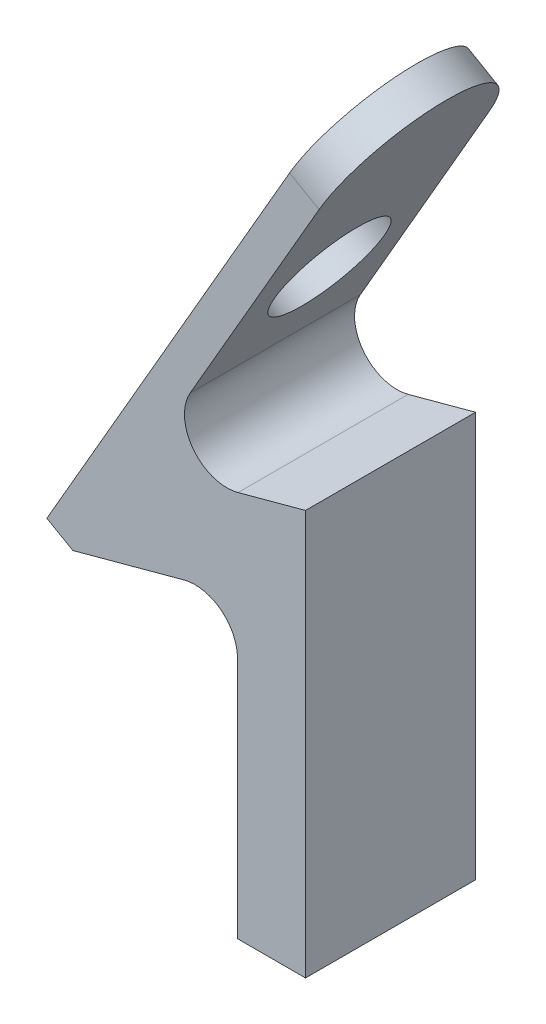
ISO-10303-21;
HEADER;
FILE_DESCRIPTION(('STEP AP214'),'2;1');
FILE_NAME('part.step','',(''),(''),'','','');
FILE_SCHEMA(('AUTOMOTIVE_DESIGN { 1 0 10303 214 1 1 1 1 }'));
ENDSEC;
DATA;
#1=APPLICATION_CONTEXT('core data for automotive mechanical design processes');
#2=APPLICATION_PROTOCOL_DEFINITION('international standard','automotive_design',2000,#1);
#3=PRODUCT_CONTEXT('',#1,'mechanical');
#4=PRODUCT('Part','Part','',(#3));
#5=PRODUCT_RELATED_PRODUCT_CATEGORY('part','',(#4));
#6=PRODUCT_DEFINITION_FORMATION('','',#4);
#7=PRODUCT_DEFINITION_CONTEXT('part definition',#1,'design');
#8=PRODUCT_DEFINITION('design','',#6,#7);
#9=PRODUCT_DEFINITION_SHAPE('','',#8);
#10=(LENGTH_UNIT() NAMED_UNIT(*) SI_UNIT(.MILLI.,.METRE.));
#11=(NAMED_UNIT(*) PLANE_ANGLE_UNIT() SI_UNIT($,.RADIAN.));
#12=(NAMED_UNIT(*) SI_UNIT($,.STERADIAN.) SOLID_ANGLE_UNIT());
#13=UNCERTAINTY_MEASURE_WITH_UNIT(LENGTH_MEASURE(1.E-05),#10,'distance_accuracy_value','');
#14=(GEOMETRIC_REPRESENTATION_CONTEXT(3) GLOBAL_UNCERTAINTY_ASSIGNED_CONTEXT((#13)) GLOBAL_UNIT_ASSIGNED_CONTEXT((#10,
#11,#12)) REPRESENTATION_CONTEXT('',''));
#15=CARTESIAN_POINT('',(0.,0.,0.));
#16=DIRECTION('',(0.,0.,1.));
#17=DIRECTION('',(1.,0.,0.));
#18=AXIS2_PLACEMENT_3D('',#15,#16,#17);
#19=CARTESIAN_POINT('',(-8.59073119504501,31.7410205271065,144.870489570875));
#20=DIRECTION('',(-0.261251278843011,0.965270826920037,0.));
#21=DIRECTION('',(-0.965270826920037,-0.261251278843011,0.));
#22=AXIS2_PLACEMENT_3D('',#19,#20,#21);
#23=PLANE('',#22);
#24=DIRECTION('',(-0.965270826920037,-0.261251278843011,0.));
#25=VECTOR('',#24,1.);
#26=CARTESIAN_POINT('',(-8.59073119504501,31.7410205271065,164.870489570875));
#27=LINE('',#26,#25);
#28=CARTESIAN_POINT('',(-70.5886003262694,14.9612503896881,164.870489570875));
#29=VERTEX_POINT('',#28);
#30=CARTESIAN_POINT('',(-78.5182177538816,12.8150934398199,164.870489570875));
#31=VERTEX_POINT('',#30);
#32=EDGE_CURVE('E140',#29,#31,#27,.T.);
#33=ORIENTED_EDGE('',*,*,#32,.F.);
#34=DIRECTION('',(0.,0.,-1.));
#35=VECTOR('',#34,1.);
#36=CARTESIAN_POINT('',(-70.5886003262694,14.9612503896881,144.870489570875));
#37=LINE('',#36,#35);
#38=CARTESIAN_POINT('',(-70.5886003262694,14.9612503896881,144.870489570875));
#39=VERTEX_POINT('',#38);
#40=EDGE_CURVE('E53',#29,#39,#37,.T.);
#41=ORIENTED_EDGE('',*,*,#40,.T.);
#42=DIRECTION('',(-0.965270826920037,-0.261251278843011,0.));
#43=VECTOR('',#42,1.);
#44=CARTESIAN_POINT('',(-8.59073119504501,31.7410205271065,144.870489570875));
#45=LINE('',#44,#43);
#46=CARTESIAN_POINT('',(-78.5182177538816,12.8150934398199,144.870489570875));
#47=VERTEX_POINT('',#46);
#48=EDGE_CURVE('E208',#39,#47,#45,.T.);
#49=ORIENTED_EDGE('',*,*,#48,.T.);
#50=DIRECTION('',(0.,0.,1.));
#51=VECTOR('',#50,1.);
#52=CARTESIAN_POINT('',(-78.5182177538816,12.8150934398199,144.870489570875));
#53=LINE('',#52,#51);
#54=EDGE_CURVE('E159',#47,#31,#53,.T.);
#55=ORIENTED_EDGE('',*,*,#54,.T.);
#56=EDGE_LOOP('',(#33,#41,#49,#55));
#57=FACE_BOUND('',#56,.T.);
#58=ADVANCED_FACE('F37',(#57),#23,.T.);
#59=CARTESIAN_POINT('',(0.,-32.6577021365863,144.870489570875));
#60=DIRECTION('',(0.,1.,0.));
#61=DIRECTION('',(0.,0.,1.));
#62=AXIS2_PLACEMENT_3D('',#59,#60,#61);
#63=PLANE('',#62);
#64=DIRECTION('',(0.,0.,-1.));
#65=VECTOR('',#64,1.);
#66=CARTESIAN_POINT('',(-70.5886003262694,-32.6577021365863,164.870489570875));
#67=LINE('',#66,#65);
#68=CARTESIAN_POINT('',(-70.5886003262694,-32.6577021365863,164.870489570875));
#69=VERTEX_POINT('',#68);
#70=CARTESIAN_POINT('',(-70.5886003262694,-32.6577021365863,144.870489570875));
#71=VERTEX_POINT('',#70);
#72=EDGE_CURVE('E121',#69,#71,#67,.T.);
#73=ORIENTED_EDGE('',*,*,#72,.F.);
#74=DIRECTION('',(-1.,0.,0.));
#75=VECTOR('',#74,1.);
#76=CARTESIAN_POINT('',(0.,-32.6577021365863,164.870489570875));
#77=LINE('',#76,#75);
#78=CARTESIAN_POINT('',(-78.5886003262694,-32.6577021365863,164.870489570875));
#79=VERTEX_POINT('',#78);
#80=EDGE_CURVE('E130',#69,#79,#77,.T.);
#81=ORIENTED_EDGE('',*,*,#80,.T.);
#82=DIRECTION('',(0.,0.,1.));
#83=VECTOR('',#82,1.);
#84=CARTESIAN_POINT('',(-78.5886003262694,-32.6577021365863,144.870489570875));
#85=LINE('',#84,#83);
#86=CARTESIAN_POINT('',(-78.5886003262694,-32.6577021365863,144.870489570875));
#87=VERTEX_POINT('',#86);
#88=EDGE_CURVE('E151',#87,#79,#85,.T.);
#89=ORIENTED_EDGE('',*,*,#88,.F.);
#90=DIRECTION('',(-1.,0.,0.));
#91=VECTOR('',#90,1.);
#92=CARTESIAN_POINT('',(0.,-32.6577021365863,144.870489570875));
#93=LINE('',#92,#91);
#94=EDGE_CURVE('E132',#71,#87,#93,.T.);
#95=ORIENTED_EDGE('',*,*,#94,.F.);
#96=EDGE_LOOP('',(#73,#81,#89,#95));
#97=FACE_BOUND('',#96,.T.);
#98=ADVANCED_FACE('F128',(#97),#63,.F.);
#99=CARTESIAN_POINT('',(0.,0.,144.870489570875));
#100=DIRECTION('',(0.,0.,1.));
#101=DIRECTION('',(1.,0.,0.));
#102=AXIS2_PLACEMENT_3D('',#99,#100,#101);
#103=PLANE('',#102);
#104=DIRECTION('',(0.,1.,0.));
#105=VECTOR('',#104,1.);
#106=CARTESIAN_POINT('',(-70.5886003262694,-32.6577021365863,144.870489570875));
#107=LINE('',#106,#105);
#108=EDGE_CURVE('E133',#71,#39,#107,.T.);
#109=ORIENTED_EDGE('',*,*,#108,.F.);
#110=ORIENTED_EDGE('',*,*,#94,.T.);
#111=DIRECTION('',(0.,-1.,0.));
#112=VECTOR('',#111,1.);
#113=CARTESIAN_POINT('',(-78.5886003262694,0.,144.870489570875));
#114=LINE('',#113,#112);
#115=CARTESIAN_POINT('',(-78.5886003262694,-4.0968896803454,144.870489570875));
#116=VERTEX_POINT('',#115);
#117=EDGE_CURVE('E211',#116,#87,#114,.T.);
#118=ORIENTED_EDGE('',*,*,#117,.F.);
#119=CARTESIAN_POINT('',(-83.5886003262694,-4.0968896803454,144.870489570875));
#120=DIRECTION('',(0.,0.,1.));
#121=DIRECTION('',(1.,0.,0.));
#122=AXIS2_PLACEMENT_3D('',#119,#120,#121);
#123=CIRCLE('',#122,5.);
#124=CARTESIAN_POINT('',(-84.8948567204845,0.729464454254775,144.870489570875));
#125=VERTEX_POINT('',#124);
#126=EDGE_CURVE('E166',#116,#125,#123,.T.);
#127=ORIENTED_EDGE('',*,*,#126,.T.);
#128=DIRECTION('',(-0.965270826920037,-0.261251278843011,0.));
#129=VECTOR('',#128,1.);
#130=CARTESIAN_POINT('',(-5.97821840661488,22.0883122579062,144.870489570875));
#131=LINE('',#130,#129);
#132=CARTESIAN_POINT('',(-97.948495719236,-2.8035128065004,144.870489570875));
#133=VERTEX_POINT('',#132);
#134=EDGE_CURVE('E185',#125,#133,#131,.T.);
#135=ORIENTED_EDGE('',*,*,#134,.T.);
#136=DIRECTION('',(-0.867282098260253,0.497816996533157,0.));
#137=VECTOR('',#136,1.);
#138=CARTESIAN_POINT('',(-101.007077292801,-1.04789730877683,144.870489570875));
#139=LINE('',#138,#137);
#140=CARTESIAN_POINT('',(-101.007077292801,-1.04789730877683,144.870489570875));
#141=VERTEX_POINT('',#140);
#142=EDGE_CURVE('E46',#133,#141,#139,.T.);
#143=ORIENTED_EDGE('',*,*,#142,.T.);
#144=DIRECTION('',(-0.499999999999999,-0.86602540378444,0.));
#145=VECTOR('',#144,1.);
#146=CARTESIAN_POINT('',(-75.3015551246221,43.4753731215978,144.870489570875));
#147=LINE('',#146,#145);
#148=CARTESIAN_POINT('',(-72.4609033212013,48.3955263717347,144.870489570875));
#149=VERTEX_POINT('',#148);
#150=EDGE_CURVE('E183',#149,#141,#147,.T.);
#151=ORIENTED_EDGE('',*,*,#150,.F.);
#152=DIRECTION('',(0.86602540378444,-0.499999999999997,0.));
#153=VECTOR('',#152,1.);
#154=CARTESIAN_POINT('',(2.8406518034208,4.92015325013702,144.870489570875));
#155=LINE('',#154,#153);
#156=CARTESIAN_POINT('',(-68.9968017060635,46.3955263717347,144.870489570875));
#157=VERTEX_POINT('',#156);
#158=EDGE_CURVE('E150',#149,#157,#155,.T.);
#159=ORIENTED_EDGE('',*,*,#158,.T.);
#160=DIRECTION('',(-0.5,-0.866025403784439,0.));
#161=VECTOR('',#160,1.);
#162=CARTESIAN_POINT('',(-71.8374535094842,41.4753731215979,144.870489570875));
#163=LINE('',#162,#161);
#164=CARTESIAN_POINT('',(-84.1546011670188,20.1414475744201,144.870489570875));
#165=VERTEX_POINT('',#164);
#166=EDGE_CURVE('E154',#157,#165,#163,.T.);
#167=ORIENTED_EDGE('',*,*,#166,.T.);
#168=CARTESIAN_POINT('',(-79.8244741480966,17.6414475744201,144.870489570875));
#169=DIRECTION('',(0.,0.,1.));
#170=DIRECTION('',(1.,0.,0.));
#171=AXIS2_PLACEMENT_3D('',#168,#169,#170);
#172=CIRCLE('',#171,5.);
#173=EDGE_CURVE('E170',#165,#47,#172,.T.);
#174=ORIENTED_EDGE('',*,*,#173,.T.);
#175=ORIENTED_EDGE('',*,*,#48,.F.);
#176=EDGE_LOOP('',(#109,#110,#118,#127,#135,#143,#151,#159,#167,#174,#175));
#177=FACE_BOUND('',#176,.T.);
#178=ADVANCED_FACE('F181',(#177),#103,.F.);
#179=CARTESIAN_POINT('',(0.,0.,164.870489570875));
#180=DIRECTION('',(0.,0.,1.));
#181=DIRECTION('',(1.,0.,0.));
#182=AXIS2_PLACEMENT_3D('',#179,#180,#181);
#183=PLANE('',#182);
#184=ORIENTED_EDGE('',*,*,#80,.F.);
#185=DIRECTION('',(0.,1.,0.));
#186=VECTOR('',#185,1.);
#187=CARTESIAN_POINT('',(-70.5886003262694,0.,164.870489570875));
#188=LINE('',#187,#186);
#189=EDGE_CURVE('E11',#69,#29,#188,.T.);
#190=ORIENTED_EDGE('',*,*,#189,.T.);
#191=ORIENTED_EDGE('',*,*,#32,.T.);
#192=CARTESIAN_POINT('',(-79.8244741480966,17.6414475744201,164.870489570875));
#193=DIRECTION('',(0.,0.,1.));
#194=DIRECTION('',(1.,0.,0.));
#195=AXIS2_PLACEMENT_3D('',#192,#193,#194);
#196=CIRCLE('',#195,5.);
#197=CARTESIAN_POINT('',(-84.1546011670188,20.1414475744201,164.870489570875));
#198=VERTEX_POINT('',#197);
#199=EDGE_CURVE('E168',#31,#198,#196,.F.);
#200=ORIENTED_EDGE('',*,*,#199,.T.);
#201=DIRECTION('',(-0.5,-0.866025403784439,0.));
#202=VECTOR('',#201,1.);
#203=CARTESIAN_POINT('',(-71.8374535094842,41.4753731215979,164.870489570875));
#204=LINE('',#203,#202);
#205=CARTESIAN_POINT('',(-68.9968017060635,46.3955263717347,164.870489570875));
#206=VERTEX_POINT('',#205);
#207=EDGE_CURVE('E142',#206,#198,#204,.T.);
#208=ORIENTED_EDGE('',*,*,#207,.F.);
#209=DIRECTION('',(0.86602540378444,-0.499999999999997,0.));
#210=VECTOR('',#209,1.);
#211=CARTESIAN_POINT('',(2.8406518034208,4.92015325013702,164.870489570875));
#212=LINE('',#211,#210);
#213=CARTESIAN_POINT('',(-72.4609033212013,48.3955263717347,164.870489570875));
#214=VERTEX_POINT('',#213);
#215=EDGE_CURVE('E200',#214,#206,#212,.T.);
#216=ORIENTED_EDGE('',*,*,#215,.F.);
#217=DIRECTION('',(-0.499999999999999,-0.86602540378444,0.));
#218=VECTOR('',#217,1.);
#219=CARTESIAN_POINT('',(-75.3015551246221,43.4753731215978,164.870489570875));
#220=LINE('',#219,#218);
#221=CARTESIAN_POINT('',(-101.007077292801,-1.04789730877683,164.870489570875));
#222=VERTEX_POINT('',#221);
#223=EDGE_CURVE('E197',#214,#222,#220,.T.);
#224=ORIENTED_EDGE('',*,*,#223,.T.);
#225=DIRECTION('',(0.867282098260253,-0.497816996533157,0.));
#226=VECTOR('',#225,1.);
#227=CARTESIAN_POINT('',(-25.484179198462,-44.3977858562535,164.870489570875));
#228=LINE('',#227,#226);
#229=CARTESIAN_POINT('',(-97.948495719236,-2.8035128065004,164.870489570875));
#230=VERTEX_POINT('',#229);
#231=EDGE_CURVE('E176',#222,#230,#228,.T.);
#232=ORIENTED_EDGE('',*,*,#231,.T.);
#233=DIRECTION('',(-0.965270826920037,-0.261251278843011,0.));
#234=VECTOR('',#233,1.);
#235=CARTESIAN_POINT('',(-5.97821840661488,22.0883122579062,164.870489570875));
#236=LINE('',#235,#234);
#237=CARTESIAN_POINT('',(-84.8948567204845,0.729464454254775,164.870489570875));
#238=VERTEX_POINT('',#237);
#239=EDGE_CURVE('E144',#238,#230,#236,.T.);
#240=ORIENTED_EDGE('',*,*,#239,.F.);
#241=CARTESIAN_POINT('',(-83.5886003262694,-4.0968896803454,164.870489570875));
#242=DIRECTION('',(0.,0.,1.));
#243=DIRECTION('',(1.,0.,0.));
#244=AXIS2_PLACEMENT_3D('',#241,#242,#243);
#245=CIRCLE('',#244,5.);
#246=CARTESIAN_POINT('',(-78.5886003262694,-4.0968896803454,164.870489570875));
#247=VERTEX_POINT('',#246);
#248=EDGE_CURVE('E164',#238,#247,#245,.F.);
#249=ORIENTED_EDGE('',*,*,#248,.T.);
#250=DIRECTION('',(0.,-1.,0.));
#251=VECTOR('',#250,1.);
#252=CARTESIAN_POINT('',(-78.5886003262694,0.,164.870489570875));
#253=LINE('',#252,#251);
#254=EDGE_CURVE('E138',#247,#79,#253,.T.);
#255=ORIENTED_EDGE('',*,*,#254,.T.);
#256=EDGE_LOOP('',(#184,#190,#191,#200,#208,#216,#224,#232,#240,#249,#255));
#257=FACE_BOUND('',#256,.T.);
#258=ADVANCED_FACE('F136',(#257),#183,.T.);
#259=CARTESIAN_POINT('',(-71.8374535094842,41.4753731215979,144.870489570875));
#260=DIRECTION('',(-0.866025403784439,0.5,0.));
#261=DIRECTION('',(-0.5,-0.866025403784439,0.));
#262=AXIS2_PLACEMENT_3D('',#259,#260,#261);
#263=PLANE('',#262);
#264=CARTESIAN_POINT('',(-77.7718017060635,31.1967805353178,154.870489570875));
#265=DIRECTION('',(-0.866025403784439,0.499999999999999,0.));
#266=DIRECTION('',(-0.499999999999999,-0.866025403784439,0.));
#267=AXIS2_PLACEMENT_3D('',#264,#265,#266);
#268=CIRCLE('',#267,6.50000000000001);
#269=CARTESIAN_POINT('',(-81.0218017060635,25.5676154107189,154.870489570875));
#270=VERTEX_POINT('',#269);
#271=EDGE_CURVE('E134',#270,#270,#268,.T.);
#272=ORIENTED_EDGE('',*,*,#271,.T.);
#273=EDGE_LOOP('',(#272));
#274=FACE_BOUND('',#273,.T.);
#275=ORIENTED_EDGE('',*,*,#207,.T.);
#276=DIRECTION('',(0.,0.,1.));
#277=VECTOR('',#276,1.);
#278=CARTESIAN_POINT('',(-84.1546011670188,20.1414475744201,144.870489570875));
#279=LINE('',#278,#277);
#280=EDGE_CURVE('E162',#198,#165,#279,.F.);
#281=ORIENTED_EDGE('',*,*,#280,.T.);
#282=ORIENTED_EDGE('',*,*,#166,.F.);
#283=CARTESIAN_POINT('',(-68.9968017060635,46.3955263717347,154.870489570875));
#284=DIRECTION('',(-0.866025403784439,0.5,0.));
#285=DIRECTION('',(-0.5,-0.866025403784439,0.));
#286=AXIS2_PLACEMENT_3D('',#283,#284,#285);
#287=CIRCLE('',#286,9.99999999999999);
#288=EDGE_CURVE('E205',#157,#206,#287,.F.);
#289=ORIENTED_EDGE('',*,*,#288,.T.);
#290=EDGE_LOOP('',(#275,#281,#282,#289));
#291=FACE_BOUND('',#290,.T.);
#292=ADVANCED_FACE('F227',(#274,#291),#263,.F.);
#293=CARTESIAN_POINT('',(-78.5886003262694,0.,144.870489570875));
#294=DIRECTION('',(-1.,0.,0.));
#295=DIRECTION('',(0.,0.,1.));
#296=AXIS2_PLACEMENT_3D('',#293,#294,#295);
#297=PLANE('',#296);
#298=ORIENTED_EDGE('',*,*,#254,.F.);
#299=DIRECTION('',(0.,0.,1.));
#300=VECTOR('',#299,1.);
#301=CARTESIAN_POINT('',(-78.5886003262694,-4.0968896803454,144.870489570875));
#302=LINE('',#301,#300);
#303=EDGE_CURVE('E157',#247,#116,#302,.F.);
#304=ORIENTED_EDGE('',*,*,#303,.T.);
#305=ORIENTED_EDGE('',*,*,#117,.T.);
#306=ORIENTED_EDGE('',*,*,#88,.T.);
#307=EDGE_LOOP('',(#298,#304,#305,#306));
#308=FACE_BOUND('',#307,.T.);
#309=ADVANCED_FACE('F248',(#308),#297,.T.);
#310=CARTESIAN_POINT('',(-5.97821840661488,22.0883122579062,144.870489570875));
#311=DIRECTION('',(-0.261251278843011,0.965270826920037,0.));
#312=DIRECTION('',(-0.965270826920037,-0.261251278843011,0.));
#313=AXIS2_PLACEMENT_3D('',#310,#311,#312);
#314=PLANE('',#313);
#315=ORIENTED_EDGE('',*,*,#239,.T.);
#316=DIRECTION('',(0.,0.,-1.));
#317=VECTOR('',#316,1.);
#318=CARTESIAN_POINT('',(-97.948495719236,-2.80351280650039,144.870489570875));
#319=LINE('',#318,#317);
#320=EDGE_CURVE('E60',#230,#133,#319,.T.);
#321=ORIENTED_EDGE('',*,*,#320,.T.);
#322=ORIENTED_EDGE('',*,*,#134,.F.);
#323=DIRECTION('',(0.,0.,1.));
#324=VECTOR('',#323,1.);
#325=CARTESIAN_POINT('',(-84.8948567204845,0.729464454254779,144.870489570875));
#326=LINE('',#325,#324);
#327=EDGE_CURVE('E153',#125,#238,#326,.T.);
#328=ORIENTED_EDGE('',*,*,#327,.T.);
#329=EDGE_LOOP('',(#315,#321,#322,#328));
#330=FACE_BOUND('',#329,.T.);
#331=ADVANCED_FACE('F198',(#330),#314,.F.);
#332=CARTESIAN_POINT('',(-75.3015551246221,43.4753731215978,144.870489570875));
#333=DIRECTION('',(-0.86602540378444,0.499999999999999,0.));
#334=DIRECTION('',(-0.499999999999999,-0.86602540378444,0.));
#335=AXIS2_PLACEMENT_3D('',#332,#333,#334);
#336=PLANE('',#335);
#337=CARTESIAN_POINT('',(-81.2359033212013,33.1967805353178,154.870489570875));
#338=DIRECTION('',(-0.866025403784439,0.499999999999999,0.));
#339=DIRECTION('',(-0.499999999999999,-0.866025403784439,0.));
#340=AXIS2_PLACEMENT_3D('',#337,#338,#339);
#341=CIRCLE('',#340,6.50000000000001);
#342=CARTESIAN_POINT('',(-84.4859033212013,27.5676154107189,154.870489570875));
#343=VERTEX_POINT('',#342);
#344=EDGE_CURVE('E221',#343,#343,#341,.T.);
#345=ORIENTED_EDGE('',*,*,#344,.F.);
#346=EDGE_LOOP('',(#345));
#347=FACE_BOUND('',#346,.T.);
#348=ORIENTED_EDGE('',*,*,#150,.T.);
#349=DIRECTION('',(0.,0.,1.));
#350=VECTOR('',#349,1.);
#351=CARTESIAN_POINT('',(-101.007077292801,-1.04789730877683,164.870489570875));
#352=LINE('',#351,#350);
#353=EDGE_CURVE('E173',#141,#222,#352,.T.);
#354=ORIENTED_EDGE('',*,*,#353,.T.);
#355=ORIENTED_EDGE('',*,*,#223,.F.);
#356=CARTESIAN_POINT('',(-72.4609033212013,48.3955263717347,154.870489570875));
#357=DIRECTION('',(-0.866025403784439,0.499999999999999,0.));
#358=DIRECTION('',(0.499999999999999,0.866025403784439,0.));
#359=AXIS2_PLACEMENT_3D('',#356,#357,#358);
#360=CIRCLE('',#359,9.99999999999999);
#361=EDGE_CURVE('E194',#214,#149,#360,.T.);
#362=ORIENTED_EDGE('',*,*,#361,.T.);
#363=EDGE_LOOP('',(#348,#354,#355,#362));
#364=FACE_BOUND('',#363,.T.);
#365=ADVANCED_FACE('F190',(#347,#364),#336,.T.);
#366=CARTESIAN_POINT('',(-83.5886003262694,-4.0968896803454,144.870489570875));
#367=DIRECTION('',(0.,0.,1.));
#368=DIRECTION('',(1.,0.,0.));
#369=AXIS2_PLACEMENT_3D('',#366,#367,#368);
#370=CYLINDRICAL_SURFACE('',#369,5.);
#371=ORIENTED_EDGE('',*,*,#126,.F.);
#372=ORIENTED_EDGE('',*,*,#303,.F.);
#373=ORIENTED_EDGE('',*,*,#248,.F.);
#374=ORIENTED_EDGE('',*,*,#327,.F.);
#375=EDGE_LOOP('',(#371,#372,#373,#374));
#376=FACE_BOUND('',#375,.T.);
#377=ADVANCED_FACE('F237',(#376),#370,.F.);
#378=CARTESIAN_POINT('',(-79.8244741480966,17.6414475744201,144.870489570875));
#379=DIRECTION('',(0.,0.,1.));
#380=DIRECTION('',(1.,0.,0.));
#381=AXIS2_PLACEMENT_3D('',#378,#379,#380);
#382=CYLINDRICAL_SURFACE('',#381,5.);
#383=ORIENTED_EDGE('',*,*,#173,.F.);
#384=ORIENTED_EDGE('',*,*,#280,.F.);
#385=ORIENTED_EDGE('',*,*,#199,.F.);
#386=ORIENTED_EDGE('',*,*,#54,.F.);
#387=EDGE_LOOP('',(#383,#384,#385,#386));
#388=FACE_BOUND('',#387,.T.);
#389=ADVANCED_FACE('F244',(#388),#382,.F.);
#390=CARTESIAN_POINT('',(-101.007077292801,-1.04789730877683,144.870489570875));
#391=DIRECTION('',(-0.497816996533157,-0.867282098260253,0.));
#392=DIRECTION('',(0.,0.,-1.));
#393=AXIS2_PLACEMENT_3D('',#390,#391,#392);
#394=PLANE('',#393);
#395=ORIENTED_EDGE('',*,*,#142,.F.);
#396=ORIENTED_EDGE('',*,*,#320,.F.);
#397=ORIENTED_EDGE('',*,*,#231,.F.);
#398=ORIENTED_EDGE('',*,*,#353,.F.);
#399=EDGE_LOOP('',(#395,#396,#397,#398));
#400=FACE_BOUND('',#399,.T.);
#401=ADVANCED_FACE('F40',(#400),#394,.T.);
#402=CARTESIAN_POINT('',(-49.6318849750264,35.2151864842358,154.870489570875));
#403=DIRECTION('',(-0.86602540378444,0.499999999999999,0.));
#404=DIRECTION('',(-0.499999999999999,-0.86602540378444,0.));
#405=AXIS2_PLACEMENT_3D('',#402,#403,#404);
#406=CYLINDRICAL_SURFACE('',#405,9.99999999999999);
#407=ORIENTED_EDGE('',*,*,#288,.F.);
#408=ORIENTED_EDGE('',*,*,#158,.F.);
#409=ORIENTED_EDGE('',*,*,#361,.F.);
#410=ORIENTED_EDGE('',*,*,#215,.T.);
#411=EDGE_LOOP('',(#407,#408,#409,#410));
#412=FACE_BOUND('',#411,.T.);
#413=ADVANCED_FACE('F276',(#412),#406,.T.);
#414=CARTESIAN_POINT('',(-70.5886003262694,0.,0.));
#415=DIRECTION('',(1.,0.,0.));
#416=DIRECTION('',(0.,0.,-1.));
#417=AXIS2_PLACEMENT_3D('',#414,#415,#416);
#418=PLANE('',#417);
#419=ORIENTED_EDGE('',*,*,#189,.F.);
#420=ORIENTED_EDGE('',*,*,#72,.T.);
#421=ORIENTED_EDGE('',*,*,#108,.T.);
#422=ORIENTED_EDGE('',*,*,#40,.F.);
#423=EDGE_LOOP('',(#419,#420,#421,#422));
#424=FACE_BOUND('',#423,.T.);
#425=ADVANCED_FACE('F120',(#424),#418,.T.);
#426=CARTESIAN_POINT('',(-77.7718017060635,31.1967805353178,154.870489570875));
#427=DIRECTION('',(-0.866025403784439,0.499999999999999,0.));
#428=DIRECTION('',(-0.499999999999999,-0.866025403784439,0.));
#429=AXIS2_PLACEMENT_3D('',#426,#427,#428);
#430=CYLINDRICAL_SURFACE('',#429,6.50000000000001);
#431=ORIENTED_EDGE('',*,*,#271,.F.);
#432=EDGE_LOOP('',(#431));
#433=FACE_BOUND('',#432,.T.);
#434=ORIENTED_EDGE('',*,*,#344,.T.);
#435=EDGE_LOOP('',(#434));
#436=FACE_BOUND('',#435,.T.);
#437=ADVANCED_FACE('F230',(#433,#436),#430,.F.);
#438=CLOSED_SHELL('',(#58,#98,#178,#258,#292,#309,#331,#365,#377,#389,#401,#413,#425,#437));
#439=MANIFOLD_SOLID_BREP('B2',#438);
#440=ADVANCED_BREP_SHAPE_REPRESENTATION('',(#18,#439),#14);
#441=SHAPE_DEFINITION_REPRESENTATION(#9,#440);
ENDSEC;
END-ISO-10303-21;
